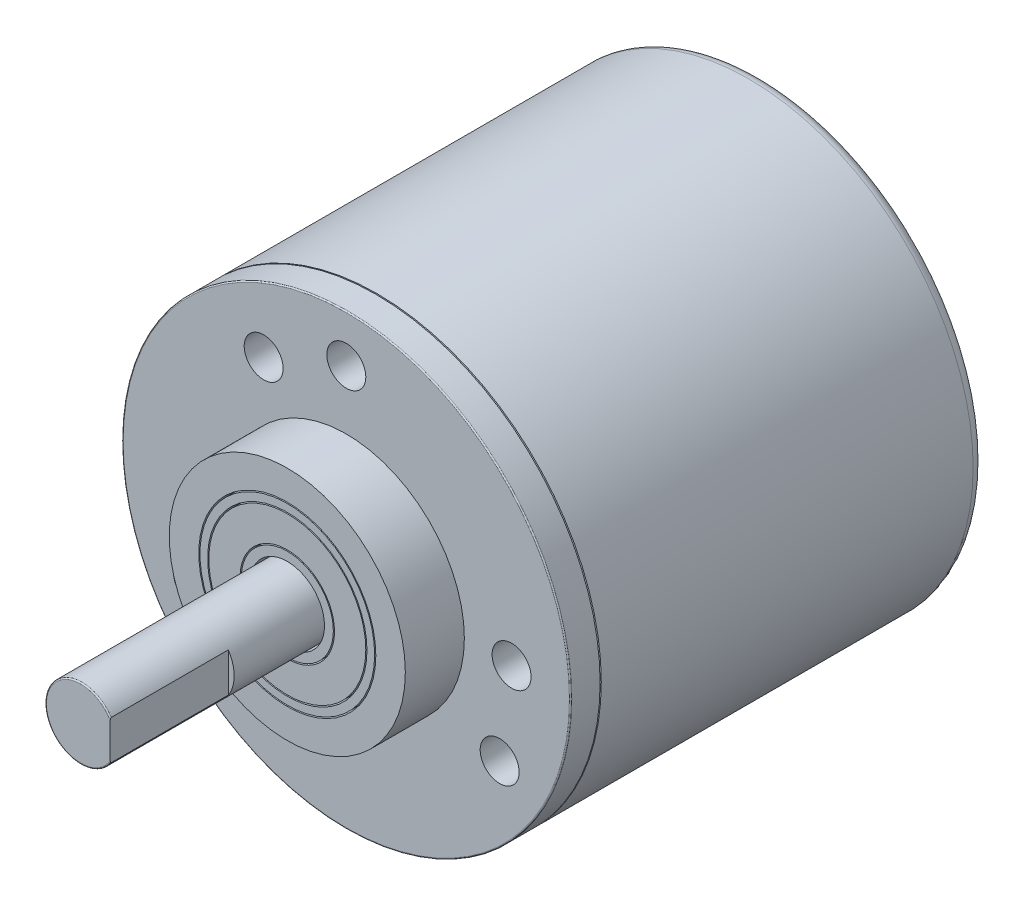
ISO-10303-21;
HEADER;
FILE_DESCRIPTION(('STEP AP214'),'2;1');
FILE_NAME('part.step','',(''),(''),'','','');
FILE_SCHEMA(('AUTOMOTIVE_DESIGN { 1 0 10303 214 1 1 1 1 }'));
ENDSEC;
DATA;
#1=APPLICATION_CONTEXT('core data for automotive mechanical design processes');
#2=APPLICATION_PROTOCOL_DEFINITION('international standard','automotive_design',2000,#1);
#3=PRODUCT_CONTEXT('',#1,'mechanical');
#4=PRODUCT('Part','Part','',(#3));
#5=PRODUCT_RELATED_PRODUCT_CATEGORY('part','',(#4));
#6=PRODUCT_DEFINITION_FORMATION('','',#4);
#7=PRODUCT_DEFINITION_CONTEXT('part definition',#1,'design');
#8=PRODUCT_DEFINITION('design','',#6,#7);
#9=PRODUCT_DEFINITION_SHAPE('','',#8);
#10=(LENGTH_UNIT() NAMED_UNIT(*) SI_UNIT(.MILLI.,.METRE.));
#11=(NAMED_UNIT(*) PLANE_ANGLE_UNIT() SI_UNIT($,.RADIAN.));
#12=(NAMED_UNIT(*) SI_UNIT($,.STERADIAN.) SOLID_ANGLE_UNIT());
#13=UNCERTAINTY_MEASURE_WITH_UNIT(LENGTH_MEASURE(1.E-05),#10,'distance_accuracy_value','');
#14=(GEOMETRIC_REPRESENTATION_CONTEXT(3) GLOBAL_UNCERTAINTY_ASSIGNED_CONTEXT((#13)) GLOBAL_UNIT_ASSIGNED_CONTEXT((#10,
#11,#12)) REPRESENTATION_CONTEXT('',''));
#15=CARTESIAN_POINT('',(0.,0.,0.));
#16=DIRECTION('',(0.,0.,1.));
#17=DIRECTION('',(1.,0.,0.));
#18=AXIS2_PLACEMENT_3D('',#15,#16,#17);
#19=CARTESIAN_POINT('',(0.,0.,57.5));
#20=DIRECTION('',(0.,0.,1.));
#21=DIRECTION('',(1.,0.,0.));
#22=AXIS2_PLACEMENT_3D('',#19,#20,#21);
#23=TOROIDAL_SURFACE('',#22,2.9,0.1);
#24=CARTESIAN_POINT('',(0.,0.,57.6));
#25=DIRECTION('',(0.,0.,1.));
#26=DIRECTION('',(1.,0.,0.));
#27=AXIS2_PLACEMENT_3D('',#24,#25,#26);
#28=CIRCLE('',#27,2.9);
#29=CARTESIAN_POINT('',(2.5,1.46969384566991,57.6));
#30=VERTEX_POINT('',#29);
#31=CARTESIAN_POINT('',(2.5,-1.46969384566991,57.6));
#32=VERTEX_POINT('',#31);
#33=EDGE_CURVE('E210',#30,#32,#28,.T.);
#34=ORIENTED_EDGE('',*,*,#33,.F.);
#35=CARTESIAN_POINT('',(2.5,1.6583123951777,57.5));
#36=CARTESIAN_POINT('',(2.5,1.65832016747273,57.5033043315846));
#37=CARTESIAN_POINT('',(2.5,1.65801657233733,57.5066002258474));
#38=CARTESIAN_POINT('',(2.5,1.6568546929146,57.5130648082912));
#39=CARTESIAN_POINT('',(2.5,1.65600120446499,57.516234347065));
#40=CARTESIAN_POINT('',(2.5,1.65380868232464,57.5223866973467));
#41=CARTESIAN_POINT('',(2.5,1.65247105389026,57.5253700202735));
#42=CARTESIAN_POINT('',(2.5,1.64939483067058,57.53112702301));
#43=CARTESIAN_POINT('',(2.5,1.64765531532508,57.5339002017954));
#44=CARTESIAN_POINT('',(2.5,1.64258823650373,57.5409942628953));
#45=CARTESIAN_POINT('',(2.5,1.6389760105066,57.5451117277358));
#46=CARTESIAN_POINT('',(2.5,1.63116073267224,57.5527388982134));
#47=CARTESIAN_POINT('',(2.5,1.62695610136376,57.5562469212209));
#48=CARTESIAN_POINT('',(2.5,1.61517985238653,57.5649124894146));
#49=CARTESIAN_POINT('',(2.5,1.60725247865166,57.5695834830336));
#50=CARTESIAN_POINT('',(2.5,1.59081085802323,57.5777187365064));
#51=CARTESIAN_POINT('',(2.5,1.58229525560931,57.5811800896697));
#52=CARTESIAN_POINT('',(2.5,1.55816356303633,57.5894377666878));
#53=CARTESIAN_POINT('',(2.5,1.54218536816765,57.5931725162884));
#54=CARTESIAN_POINT('',(2.5,1.50985447657944,57.5982642473057));
#55=CARTESIAN_POINT('',(2.5,1.49350079252433,57.5996139959403));
#56=CARTESIAN_POINT('',(2.5,1.45940800421217,57.6002693722088));
#57=CARTESIAN_POINT('',(2.5,1.44166495945654,57.5993988287185));
#58=CARTESIAN_POINT('',(2.5,1.41535304430469,57.5963405067919));
#59=CARTESIAN_POINT('',(2.5,1.40667255862976,57.5950390433996));
#60=CARTESIAN_POINT('',(2.5,1.38942535559259,57.5918253448798));
#61=CARTESIAN_POINT('',(2.5,1.38085864504972,57.5899130733125));
#62=CARTESIAN_POINT('',(2.5,1.37236992406489,57.5876783681764));
#63=B_SPLINE_CURVE_WITH_KNOTS('',3,(#35,#36,#37,#38,#39,#40,#41,#42,#43,#44,#45,#46,#47,#48,#49,
#50,#51,#52,#53,#54,#55,#56,#57,#58,#59,#60,#61,#62),.UNSPECIFIED.,.F.,.F.,(4,2,2,2,2,2,2,2,2,2,
2,2,2,4),(0.,0.00988566562161051,0.0196862605432219,0.0294586336099737,0.0392536171390137,
0.0555908527347773,0.0719725012890701,0.0994204413165509,0.126933890702367,0.175887268292354,
0.224988849318987,0.278105433700327,0.304419885579329,0.330735907624068),.UNSPECIFIED.);
#64=CARTESIAN_POINT('',(2.5,1.6583123951777,57.5));
#65=VERTEX_POINT('',#64);
#66=EDGE_CURVE('E213',#65,#30,#63,.T.);
#67=ORIENTED_EDGE('',*,*,#66,.F.);
#68=CARTESIAN_POINT('',(0.,0.,57.5));
#69=DIRECTION('',(0.,0.,1.));
#70=DIRECTION('',(1.,0.,0.));
#71=AXIS2_PLACEMENT_3D('',#68,#69,#70);
#72=CIRCLE('',#71,3.);
#73=CARTESIAN_POINT('',(2.5,-1.6583123951777,57.5));
#74=VERTEX_POINT('',#73);
#75=EDGE_CURVE('E55',#74,#65,#72,.F.);
#76=ORIENTED_EDGE('',*,*,#75,.F.);
#77=CARTESIAN_POINT('',(2.5,-1.46969384566991,57.6));
#78=CARTESIAN_POINT('',(2.5,-1.47810925765124,57.5999973788352));
#79=CARTESIAN_POINT('',(2.5,-1.48651836655769,57.5997277262453));
#80=CARTESIAN_POINT('',(2.5,-1.50332398214389,57.5986099843118));
#81=CARTESIAN_POINT('',(2.5,-1.51172036691204,57.5977600863656));
#82=CARTESIAN_POINT('',(2.5,-1.53688791569613,57.5942647180817));
#83=CARTESIAN_POINT('',(2.5,-1.55355942531334,57.5906727650936));
#84=CARTESIAN_POINT('',(2.5,-1.57602029228909,57.5834080329952));
#85=CARTESIAN_POINT('',(2.5,-1.58226416184587,57.581111728344));
#86=CARTESIAN_POINT('',(2.5,-1.59451045067397,57.5759338303621));
#87=CARTESIAN_POINT('',(2.5,-1.60051287515901,57.5730522496778));
#88=CARTESIAN_POINT('',(2.5,-1.61219827924205,57.5665775882826));
#89=CARTESIAN_POINT('',(2.5,-1.61787785242862,57.5629782678524));
#90=CARTESIAN_POINT('',(2.5,-1.62862955339004,57.5549575685428));
#91=CARTESIAN_POINT('',(2.5,-1.63370313393867,57.5505382233183));
#92=CARTESIAN_POINT('',(2.5,-1.64097163485322,57.5427723045354));
#93=CARTESIAN_POINT('',(2.5,-1.64349231113633,57.5397320136597));
#94=CARTESIAN_POINT('',(2.5,-1.64806921646917,57.5333172153581));
#95=CARTESIAN_POINT('',(2.5,-1.65012584989765,57.5299430026383));
#96=CARTESIAN_POINT('',(2.5,-1.653653564797,57.5228406553153));
#97=CARTESIAN_POINT('',(2.5,-1.6551168506931,57.5191085586367));
#98=CARTESIAN_POINT('',(2.5,-1.65726471976403,57.5114250035943));
#99=CARTESIAN_POINT('',(2.5,-1.65795047905608,57.5074738860524));
#100=CARTESIAN_POINT('',(2.5,-1.65841532318103,57.5001165615912));
#101=CARTESIAN_POINT('',(2.5,-1.65831499581992,57.4967175330463));
#102=CARTESIAN_POINT('',(2.5,-1.65750735578859,57.4899701216566));
#103=CARTESIAN_POINT('',(2.5,-1.65679619745144,57.4866221967504));
#104=CARTESIAN_POINT('',(2.5,-1.65579088619706,57.483366437867));
#105=B_SPLINE_CURVE_WITH_KNOTS('',3,(#77,#78,#79,#80,#81,#82,#83,#84,#85,#86,#87,#88,#89,#90,
#91,#92,#93,#94,#95,#96,#97,#98,#99,#100,#101,#102,#103,#104),.UNSPECIFIED.,.F.,.F.,(4,2,2,2,2,
2,2,2,2,2,2,2,2,4),(0.,0.0252278596581849,0.0505347147733773,0.101380931299572,
0.121318175249538,0.141254988446909,0.161373338353004,0.181442446056375,0.193257887548058,
0.205062992652412,0.217018528762323,0.228955956231327,0.239102493319808,0.249313383120048),.UNSPECIFIED.);
#106=EDGE_CURVE('E221',#32,#74,#105,.T.);
#107=ORIENTED_EDGE('',*,*,#106,.F.);
#108=EDGE_LOOP('',(#34,#67,#76,#107));
#109=FACE_BOUND('',#108,.T.);
#110=ADVANCED_FACE('F40',(#109),#23,.T.);
#111=CARTESIAN_POINT('',(0.,0.,32.5));
#112=DIRECTION('',(0.,0.,-1.));
#113=DIRECTION('',(-1.,0.,0.));
#114=AXIS2_PLACEMENT_3D('',#111,#112,#113);
#115=CYLINDRICAL_SURFACE('',#114,19.);
#116=CARTESIAN_POINT('',(0.,0.,1.));
#117=DIRECTION('',(0.,0.,1.));
#118=DIRECTION('',(1.,0.,0.));
#119=AXIS2_PLACEMENT_3D('',#116,#117,#118);
#120=CIRCLE('',#119,19.);
#121=CARTESIAN_POINT('',(19.,0.,1.));
#122=VERTEX_POINT('',#121);
#123=EDGE_CURVE('E48',#122,#122,#120,.T.);
#124=ORIENTED_EDGE('',*,*,#123,.T.);
#125=EDGE_LOOP('',(#124));
#126=FACE_BOUND('',#125,.T.);
#127=CARTESIAN_POINT('',(0.,0.,32.5));
#128=DIRECTION('',(0.,0.,1.));
#129=DIRECTION('',(1.,0.,0.));
#130=AXIS2_PLACEMENT_3D('',#127,#128,#129);
#131=CIRCLE('',#130,19.);
#132=CARTESIAN_POINT('',(19.,0.,32.5));
#133=VERTEX_POINT('',#132);
#134=EDGE_CURVE('E191',#133,#133,#131,.T.);
#135=ORIENTED_EDGE('',*,*,#134,.F.);
#136=EDGE_LOOP('',(#135));
#137=FACE_BOUND('',#136,.T.);
#138=ADVANCED_FACE('F325',(#126,#137),#115,.T.);
#139=CARTESIAN_POINT('',(0.,0.,32.5));
#140=DIRECTION('',(0.,0.,1.));
#141=DIRECTION('',(1.,0.,0.));
#142=AXIS2_PLACEMENT_3D('',#139,#140,#141);
#143=PLANE('',#142);
#144=CARTESIAN_POINT('',(0.,0.,32.5));
#145=DIRECTION('',(0.,0.,1.));
#146=DIRECTION('',(1.,0.,0.));
#147=AXIS2_PLACEMENT_3D('',#144,#145,#146);
#148=CIRCLE('',#147,18.5);
#149=CARTESIAN_POINT('',(18.5,0.,32.5));
#150=VERTEX_POINT('',#149);
#151=EDGE_CURVE('E185',#150,#150,#148,.T.);
#152=ORIENTED_EDGE('',*,*,#151,.F.);
#153=EDGE_LOOP('',(#152));
#154=FACE_BOUND('',#153,.T.);
#155=ORIENTED_EDGE('',*,*,#134,.T.);
#156=EDGE_LOOP('',(#155));
#157=FACE_BOUND('',#156,.T.);
#158=ADVANCED_FACE('F322',(#154,#157),#143,.T.);
#159=CARTESIAN_POINT('',(0.,0.,0.));
#160=DIRECTION('',(0.,0.,1.));
#161=DIRECTION('',(1.,0.,0.));
#162=AXIS2_PLACEMENT_3D('',#159,#160,#161);
#163=PLANE('',#162);
#164=CARTESIAN_POINT('',(0.,0.,0.));
#165=DIRECTION('',(0.,0.,1.));
#166=DIRECTION('',(1.,0.,0.));
#167=AXIS2_PLACEMENT_3D('',#164,#165,#166);
#168=CIRCLE('',#167,18.);
#169=CARTESIAN_POINT('',(18.,0.,0.));
#170=VERTEX_POINT('',#169);
#171=EDGE_CURVE('E11',#170,#170,#168,.F.);
#172=ORIENTED_EDGE('',*,*,#171,.T.);
#173=EDGE_LOOP('',(#172));
#174=FACE_BOUND('',#173,.T.);
#175=ADVANCED_FACE('F320',(#174),#163,.F.);
#176=CARTESIAN_POINT('',(0.,0.,32.6));
#177=DIRECTION('',(0.,0.,-1.));
#178=DIRECTION('',(-1.,0.,0.));
#179=AXIS2_PLACEMENT_3D('',#176,#177,#178);
#180=CYLINDRICAL_SURFACE('',#179,18.5);
#181=CARTESIAN_POINT('',(0.,0.,32.6));
#182=DIRECTION('',(0.,0.,1.));
#183=DIRECTION('',(1.,0.,0.));
#184=AXIS2_PLACEMENT_3D('',#181,#182,#183);
#185=CIRCLE('',#184,18.5);
#186=CARTESIAN_POINT('',(18.5,0.,32.6));
#187=VERTEX_POINT('',#186);
#188=EDGE_CURVE('E188',#187,#187,#185,.T.);
#189=ORIENTED_EDGE('',*,*,#188,.F.);
#190=EDGE_LOOP('',(#189));
#191=FACE_BOUND('',#190,.T.);
#192=ORIENTED_EDGE('',*,*,#151,.T.);
#193=EDGE_LOOP('',(#192));
#194=FACE_BOUND('',#193,.T.);
#195=ADVANCED_FACE('F316',(#191,#194),#180,.T.);
#196=CARTESIAN_POINT('',(0.,0.,35.1));
#197=DIRECTION('',(0.,0.,-1.));
#198=DIRECTION('',(-1.,0.,0.));
#199=AXIS2_PLACEMENT_3D('',#196,#197,#198);
#200=CYLINDRICAL_SURFACE('',#199,19.);
#201=CARTESIAN_POINT('',(0.,0.,35.));
#202=DIRECTION('',(0.,0.,1.));
#203=DIRECTION('',(1.,0.,0.));
#204=AXIS2_PLACEMENT_3D('',#201,#202,#203);
#205=CIRCLE('',#204,19.);
#206=CARTESIAN_POINT('',(19.,0.,35.));
#207=VERTEX_POINT('',#206);
#208=EDGE_CURVE('E340',#207,#207,#205,.F.);
#209=ORIENTED_EDGE('',*,*,#208,.T.);
#210=EDGE_LOOP('',(#209));
#211=FACE_BOUND('',#210,.T.);
#212=CARTESIAN_POINT('',(0.,0.,32.6));
#213=DIRECTION('',(0.,0.,1.));
#214=DIRECTION('',(1.,0.,0.));
#215=AXIS2_PLACEMENT_3D('',#212,#213,#214);
#216=CIRCLE('',#215,19.);
#217=CARTESIAN_POINT('',(19.,0.,32.6));
#218=VERTEX_POINT('',#217);
#219=EDGE_CURVE('E180',#218,#218,#216,.T.);
#220=ORIENTED_EDGE('',*,*,#219,.T.);
#221=EDGE_LOOP('',(#220));
#222=FACE_BOUND('',#221,.T.);
#223=ADVANCED_FACE('F309',(#211,#222),#200,.T.);
#224=CARTESIAN_POINT('',(0.,0.,35.1));
#225=DIRECTION('',(0.,0.,1.));
#226=DIRECTION('',(1.,0.,0.));
#227=AXIS2_PLACEMENT_3D('',#224,#225,#226);
#228=PLANE('',#227);
#229=CARTESIAN_POINT('',(-6.99999999999993,12.1243556529822,35.1));
#230=DIRECTION('',(0.,0.,1.));
#231=DIRECTION('',(1.,0.,0.));
#232=AXIS2_PLACEMENT_3D('',#229,#230,#231);
#233=CIRCLE('',#232,1.64999999999999);
#234=CARTESIAN_POINT('',(-5.34999999999994,12.1243556529822,35.1));
#235=VERTEX_POINT('',#234);
#236=EDGE_CURVE('E100',#235,#235,#233,.T.);
#237=ORIENTED_EDGE('',*,*,#236,.F.);
#238=EDGE_LOOP('',(#237));
#239=FACE_BOUND('',#238,.T.);
#240=CARTESIAN_POINT('',(0.,15.,35.1));
#241=DIRECTION('',(0.,0.,1.));
#242=DIRECTION('',(1.,0.,0.));
#243=AXIS2_PLACEMENT_3D('',#240,#241,#242);
#244=CIRCLE('',#243,1.64999999999999);
#245=CARTESIAN_POINT('',(1.64999999999999,15.,35.1));
#246=VERTEX_POINT('',#245);
#247=EDGE_CURVE('E99',#246,#246,#244,.T.);
#248=ORIENTED_EDGE('',*,*,#247,.F.);
#249=EDGE_LOOP('',(#248));
#250=FACE_BOUND('',#249,.T.);
#251=CARTESIAN_POINT('',(14.0000000000009,-2.67147415300428E-13,35.1));
#252=DIRECTION('',(0.,0.,1.));
#253=DIRECTION('',(1.,0.,0.));
#254=AXIS2_PLACEMENT_3D('',#251,#252,#253);
#255=CIRCLE('',#254,1.64999999999999);
#256=CARTESIAN_POINT('',(15.6500000000008,-2.67147415300428E-13,35.1));
#257=VERTEX_POINT('',#256);
#258=EDGE_CURVE('E110',#257,#257,#255,.T.);
#259=ORIENTED_EDGE('',*,*,#258,.F.);
#260=EDGE_LOOP('',(#259));
#261=FACE_BOUND('',#260,.T.);
#262=CARTESIAN_POINT('',(12.9903810567656,-7.50000000000172,35.1));
#263=DIRECTION('',(0.,0.,1.));
#264=DIRECTION('',(1.,0.,0.));
#265=AXIS2_PLACEMENT_3D('',#262,#263,#264);
#266=CIRCLE('',#265,1.64999999999999);
#267=CARTESIAN_POINT('',(14.6403810567656,-7.50000000000172,35.1));
#268=VERTEX_POINT('',#267);
#269=EDGE_CURVE('E116',#268,#268,#266,.T.);
#270=ORIENTED_EDGE('',*,*,#269,.F.);
#271=EDGE_LOOP('',(#270));
#272=FACE_BOUND('',#271,.T.);
#273=CARTESIAN_POINT('',(-7.00000000000088,-12.1243556529811,35.1));
#274=DIRECTION('',(0.,0.,1.));
#275=DIRECTION('',(1.,0.,0.));
#276=AXIS2_PLACEMENT_3D('',#273,#274,#275);
#277=CIRCLE('',#276,1.64999999999999);
#278=CARTESIAN_POINT('',(-5.35000000000089,-12.1243556529811,35.1));
#279=VERTEX_POINT('',#278);
#280=EDGE_CURVE('E122',#279,#279,#277,.T.);
#281=ORIENTED_EDGE('',*,*,#280,.F.);
#282=EDGE_LOOP('',(#281));
#283=FACE_BOUND('',#282,.T.);
#284=CARTESIAN_POINT('',(-12.9903810567686,-7.49999999999657,35.1));
#285=DIRECTION('',(0.,0.,1.));
#286=DIRECTION('',(1.,0.,0.));
#287=AXIS2_PLACEMENT_3D('',#284,#285,#286);
#288=CIRCLE('',#287,1.64999999999999);
#289=CARTESIAN_POINT('',(-11.3403810567686,-7.49999999999657,35.1));
#290=VERTEX_POINT('',#289);
#291=EDGE_CURVE('E128',#290,#290,#288,.T.);
#292=ORIENTED_EDGE('',*,*,#291,.F.);
#293=EDGE_LOOP('',(#292));
#294=FACE_BOUND('',#293,.T.);
#295=CARTESIAN_POINT('',(0.,0.,35.1));
#296=DIRECTION('',(0.,0.,1.));
#297=DIRECTION('',(1.,0.,0.));
#298=AXIS2_PLACEMENT_3D('',#295,#296,#297);
#299=CIRCLE('',#298,18.9);
#300=CARTESIAN_POINT('',(18.9,0.,35.1));
#301=VERTEX_POINT('',#300);
#302=EDGE_CURVE('E342',#301,#301,#299,.T.);
#303=ORIENTED_EDGE('',*,*,#302,.T.);
#304=EDGE_LOOP('',(#303));
#305=FACE_BOUND('',#304,.T.);
#306=CARTESIAN_POINT('',(0.,0.,35.1));
#307=DIRECTION('',(0.,0.,1.));
#308=DIRECTION('',(1.,0.,0.));
#309=AXIS2_PLACEMENT_3D('',#306,#307,#308);
#310=CIRCLE('',#309,10.);
#311=CARTESIAN_POINT('',(10.,0.,35.1));
#312=VERTEX_POINT('',#311);
#313=EDGE_CURVE('E181',#312,#312,#310,.T.);
#314=ORIENTED_EDGE('',*,*,#313,.F.);
#315=EDGE_LOOP('',(#314));
#316=FACE_BOUND('',#315,.T.);
#317=ADVANCED_FACE('F306',(#239,#250,#261,#272,#283,#294,#305,#316),#228,.T.);
#318=CARTESIAN_POINT('',(0.,0.,32.6));
#319=DIRECTION('',(0.,0.,1.));
#320=DIRECTION('',(1.,0.,0.));
#321=AXIS2_PLACEMENT_3D('',#318,#319,#320);
#322=PLANE('',#321);
#323=ORIENTED_EDGE('',*,*,#188,.T.);
#324=EDGE_LOOP('',(#323));
#325=FACE_BOUND('',#324,.T.);
#326=ORIENTED_EDGE('',*,*,#219,.F.);
#327=EDGE_LOOP('',(#326));
#328=FACE_BOUND('',#327,.T.);
#329=ADVANCED_FACE('F304',(#325,#328),#322,.F.);
#330=CARTESIAN_POINT('',(0.,0.,40.1));
#331=DIRECTION('',(0.,0.,-1.));
#332=DIRECTION('',(-1.,0.,0.));
#333=AXIS2_PLACEMENT_3D('',#330,#331,#332);
#334=CYLINDRICAL_SURFACE('',#333,10.);
#335=CARTESIAN_POINT('',(0.,0.,40.1));
#336=DIRECTION('',(0.,0.,1.));
#337=DIRECTION('',(1.,0.,0.));
#338=AXIS2_PLACEMENT_3D('',#335,#336,#337);
#339=CIRCLE('',#338,10.);
#340=CARTESIAN_POINT('',(10.,0.,40.1));
#341=VERTEX_POINT('',#340);
#342=EDGE_CURVE('E175',#341,#341,#339,.T.);
#343=ORIENTED_EDGE('',*,*,#342,.F.);
#344=EDGE_LOOP('',(#343));
#345=FACE_BOUND('',#344,.T.);
#346=ORIENTED_EDGE('',*,*,#313,.T.);
#347=EDGE_LOOP('',(#346));
#348=FACE_BOUND('',#347,.T.);
#349=ADVANCED_FACE('F300',(#345,#348),#334,.T.);
#350=CARTESIAN_POINT('',(0.,0.,40.1));
#351=DIRECTION('',(0.,0.,1.));
#352=DIRECTION('',(1.,0.,0.));
#353=AXIS2_PLACEMENT_3D('',#350,#351,#352);
#354=PLANE('',#353);
#355=CARTESIAN_POINT('',(0.,0.,40.1));
#356=DIRECTION('',(0.,0.,1.));
#357=DIRECTION('',(1.,0.,0.));
#358=AXIS2_PLACEMENT_3D('',#355,#356,#357);
#359=CIRCLE('',#358,7.5);
#360=CARTESIAN_POINT('',(7.5,0.,40.1));
#361=VERTEX_POINT('',#360);
#362=EDGE_CURVE('E169',#361,#361,#359,.T.);
#363=ORIENTED_EDGE('',*,*,#362,.F.);
#364=EDGE_LOOP('',(#363));
#365=FACE_BOUND('',#364,.T.);
#366=ORIENTED_EDGE('',*,*,#342,.T.);
#367=EDGE_LOOP('',(#366));
#368=FACE_BOUND('',#367,.T.);
#369=ADVANCED_FACE('F296',(#365,#368),#354,.T.);
#370=CARTESIAN_POINT('',(0.,0.,37.1));
#371=DIRECTION('',(0.,0.,1.));
#372=DIRECTION('',(1.,0.,0.));
#373=AXIS2_PLACEMENT_3D('',#370,#371,#372);
#374=CYLINDRICAL_SURFACE('',#373,7.5);
#375=CARTESIAN_POINT('',(0.,0.,37.1));
#376=DIRECTION('',(0.,0.,1.));
#377=DIRECTION('',(1.,0.,0.));
#378=AXIS2_PLACEMENT_3D('',#375,#376,#377);
#379=CIRCLE('',#378,7.5);
#380=CARTESIAN_POINT('',(7.5,0.,37.1));
#381=VERTEX_POINT('',#380);
#382=EDGE_CURVE('E172',#381,#381,#379,.T.);
#383=ORIENTED_EDGE('',*,*,#382,.F.);
#384=EDGE_LOOP('',(#383));
#385=FACE_BOUND('',#384,.T.);
#386=ORIENTED_EDGE('',*,*,#362,.T.);
#387=EDGE_LOOP('',(#386));
#388=FACE_BOUND('',#387,.T.);
#389=ADVANCED_FACE('F292',(#385,#388),#374,.F.);
#390=CARTESIAN_POINT('',(0.,0.,37.1));
#391=DIRECTION('',(0.,0.,1.));
#392=DIRECTION('',(1.,0.,0.));
#393=AXIS2_PLACEMENT_3D('',#390,#391,#392);
#394=PLANE('',#393);
#395=CARTESIAN_POINT('',(0.,0.,37.1));
#396=DIRECTION('',(0.,0.,1.));
#397=DIRECTION('',(1.,0.,0.));
#398=AXIS2_PLACEMENT_3D('',#395,#396,#397);
#399=CIRCLE('',#398,7.4);
#400=CARTESIAN_POINT('',(7.4,0.,37.1));
#401=VERTEX_POINT('',#400);
#402=EDGE_CURVE('E165',#401,#401,#399,.T.);
#403=ORIENTED_EDGE('',*,*,#402,.F.);
#404=EDGE_LOOP('',(#403));
#405=FACE_BOUND('',#404,.T.);
#406=ORIENTED_EDGE('',*,*,#382,.T.);
#407=EDGE_LOOP('',(#406));
#408=FACE_BOUND('',#407,.T.);
#409=ADVANCED_FACE('F285',(#405,#408),#394,.T.);
#410=CARTESIAN_POINT('',(0.,0.,40.1));
#411=DIRECTION('',(0.,0.,1.));
#412=DIRECTION('',(1.,0.,0.));
#413=AXIS2_PLACEMENT_3D('',#410,#411,#412);
#414=PLANE('',#413);
#415=CARTESIAN_POINT('',(0.,0.,40.1));
#416=DIRECTION('',(0.,0.,1.));
#417=DIRECTION('',(1.,0.,0.));
#418=AXIS2_PLACEMENT_3D('',#415,#416,#417);
#419=CIRCLE('',#418,7.4);
#420=CARTESIAN_POINT('',(7.4,0.,40.1));
#421=VERTEX_POINT('',#420);
#422=EDGE_CURVE('E166',#421,#421,#419,.T.);
#423=ORIENTED_EDGE('',*,*,#422,.T.);
#424=EDGE_LOOP('',(#423));
#425=FACE_BOUND('',#424,.T.);
#426=CARTESIAN_POINT('',(0.,0.,40.1));
#427=DIRECTION('',(0.,0.,1.));
#428=DIRECTION('',(1.,0.,0.));
#429=AXIS2_PLACEMENT_3D('',#426,#427,#428);
#430=CIRCLE('',#429,6.75);
#431=CARTESIAN_POINT('',(6.75,0.,40.1));
#432=VERTEX_POINT('',#431);
#433=EDGE_CURVE('E160',#432,#432,#430,.T.);
#434=ORIENTED_EDGE('',*,*,#433,.F.);
#435=EDGE_LOOP('',(#434));
#436=FACE_BOUND('',#435,.T.);
#437=ADVANCED_FACE('F282',(#425,#436),#414,.T.);
#438=CARTESIAN_POINT('',(0.,0.,40.1));
#439=DIRECTION('',(0.,0.,-1.));
#440=DIRECTION('',(-1.,0.,0.));
#441=AXIS2_PLACEMENT_3D('',#438,#439,#440);
#442=CYLINDRICAL_SURFACE('',#441,7.4);
#443=ORIENTED_EDGE('',*,*,#422,.F.);
#444=EDGE_LOOP('',(#443));
#445=FACE_BOUND('',#444,.T.);
#446=ORIENTED_EDGE('',*,*,#402,.T.);
#447=EDGE_LOOP('',(#446));
#448=FACE_BOUND('',#447,.T.);
#449=ADVANCED_FACE('F280',(#445,#448),#442,.T.);
#450=CARTESIAN_POINT('',(0.,0.,40.1));
#451=DIRECTION('',(0.,0.,-1.));
#452=DIRECTION('',(-1.,0.,0.));
#453=AXIS2_PLACEMENT_3D('',#450,#451,#452);
#454=CYLINDRICAL_SURFACE('',#453,6.75);
#455=ORIENTED_EDGE('',*,*,#433,.T.);
#456=EDGE_LOOP('',(#455));
#457=FACE_BOUND('',#456,.T.);
#458=CARTESIAN_POINT('',(0.,0.,37.1));
#459=DIRECTION('',(0.,0.,1.));
#460=DIRECTION('',(1.,0.,0.));
#461=AXIS2_PLACEMENT_3D('',#458,#459,#460);
#462=CIRCLE('',#461,6.75);
#463=CARTESIAN_POINT('',(6.75,0.,37.1));
#464=VERTEX_POINT('',#463);
#465=EDGE_CURVE('E184',#464,#464,#462,.F.);
#466=ORIENTED_EDGE('',*,*,#465,.T.);
#467=EDGE_LOOP('',(#466));
#468=FACE_BOUND('',#467,.T.);
#469=ADVANCED_FACE('F277',(#457,#468),#454,.F.);
#470=CARTESIAN_POINT('',(0.,0.,37.1));
#471=DIRECTION('',(0.,0.,1.));
#472=DIRECTION('',(1.,0.,0.));
#473=AXIS2_PLACEMENT_3D('',#470,#471,#472);
#474=CIRCLE('',#473,6.65);
#475=CARTESIAN_POINT('',(6.65,0.,37.1));
#476=VERTEX_POINT('',#475);
#477=EDGE_CURVE('E156',#476,#476,#474,.T.);
#478=ORIENTED_EDGE('',*,*,#477,.F.);
#479=EDGE_LOOP('',(#478));
#480=FACE_BOUND('',#479,.T.);
#481=ORIENTED_EDGE('',*,*,#465,.F.);
#482=EDGE_LOOP('',(#481));
#483=FACE_BOUND('',#482,.T.);
#484=ADVANCED_FACE('F272',(#480,#483),#394,.T.);
#485=CARTESIAN_POINT('',(0.,0.,40.1));
#486=DIRECTION('',(0.,0.,1.));
#487=DIRECTION('',(1.,0.,0.));
#488=AXIS2_PLACEMENT_3D('',#485,#486,#487);
#489=PLANE('',#488);
#490=CARTESIAN_POINT('',(0.,0.,40.1));
#491=DIRECTION('',(0.,0.,1.));
#492=DIRECTION('',(1.,0.,0.));
#493=AXIS2_PLACEMENT_3D('',#490,#491,#492);
#494=CIRCLE('',#493,6.65);
#495=CARTESIAN_POINT('',(6.65,0.,40.1));
#496=VERTEX_POINT('',#495);
#497=EDGE_CURVE('E157',#496,#496,#494,.T.);
#498=ORIENTED_EDGE('',*,*,#497,.T.);
#499=EDGE_LOOP('',(#498));
#500=FACE_BOUND('',#499,.T.);
#501=CARTESIAN_POINT('',(0.,0.,40.1));
#502=DIRECTION('',(0.,0.,1.));
#503=DIRECTION('',(1.,0.,0.));
#504=AXIS2_PLACEMENT_3D('',#501,#502,#503);
#505=CIRCLE('',#504,4.);
#506=CARTESIAN_POINT('',(4.,0.,40.1));
#507=VERTEX_POINT('',#506);
#508=EDGE_CURVE('E151',#507,#507,#505,.T.);
#509=ORIENTED_EDGE('',*,*,#508,.F.);
#510=EDGE_LOOP('',(#509));
#511=FACE_BOUND('',#510,.T.);
#512=ADVANCED_FACE('F269',(#500,#511),#489,.T.);
#513=CARTESIAN_POINT('',(0.,0.,40.1));
#514=DIRECTION('',(0.,0.,-1.));
#515=DIRECTION('',(-1.,0.,0.));
#516=AXIS2_PLACEMENT_3D('',#513,#514,#515);
#517=CYLINDRICAL_SURFACE('',#516,6.65);
#518=ORIENTED_EDGE('',*,*,#497,.F.);
#519=EDGE_LOOP('',(#518));
#520=FACE_BOUND('',#519,.T.);
#521=ORIENTED_EDGE('',*,*,#477,.T.);
#522=EDGE_LOOP('',(#521));
#523=FACE_BOUND('',#522,.T.);
#524=ADVANCED_FACE('F267',(#520,#523),#517,.T.);
#525=CARTESIAN_POINT('',(0.,0.,40.1));
#526=DIRECTION('',(0.,0.,-1.));
#527=DIRECTION('',(-1.,0.,0.));
#528=AXIS2_PLACEMENT_3D('',#525,#526,#527);
#529=CYLINDRICAL_SURFACE('',#528,4.);
#530=ORIENTED_EDGE('',*,*,#508,.T.);
#531=EDGE_LOOP('',(#530));
#532=FACE_BOUND('',#531,.T.);
#533=CARTESIAN_POINT('',(0.,0.,37.1));
#534=DIRECTION('',(0.,0.,1.));
#535=DIRECTION('',(1.,0.,0.));
#536=AXIS2_PLACEMENT_3D('',#533,#534,#535);
#537=CIRCLE('',#536,4.);
#538=CARTESIAN_POINT('',(4.,0.,37.1));
#539=VERTEX_POINT('',#538);
#540=EDGE_CURVE('E198',#539,#539,#537,.F.);
#541=ORIENTED_EDGE('',*,*,#540,.T.);
#542=EDGE_LOOP('',(#541));
#543=FACE_BOUND('',#542,.T.);
#544=ADVANCED_FACE('F264',(#532,#543),#529,.F.);
#545=CARTESIAN_POINT('',(0.,0.,37.1));
#546=DIRECTION('',(0.,0.,1.));
#547=DIRECTION('',(1.,0.,0.));
#548=AXIS2_PLACEMENT_3D('',#545,#546,#547);
#549=CIRCLE('',#548,3.9);
#550=CARTESIAN_POINT('',(3.9,0.,37.1));
#551=VERTEX_POINT('',#550);
#552=EDGE_CURVE('E147',#551,#551,#549,.T.);
#553=ORIENTED_EDGE('',*,*,#552,.F.);
#554=EDGE_LOOP('',(#553));
#555=FACE_BOUND('',#554,.T.);
#556=ORIENTED_EDGE('',*,*,#540,.F.);
#557=EDGE_LOOP('',(#556));
#558=FACE_BOUND('',#557,.T.);
#559=ADVANCED_FACE('F259',(#555,#558),#394,.T.);
#560=CARTESIAN_POINT('',(0.,0.,40.1));
#561=DIRECTION('',(0.,0.,1.));
#562=DIRECTION('',(1.,0.,0.));
#563=AXIS2_PLACEMENT_3D('',#560,#561,#562);
#564=PLANE('',#563);
#565=CARTESIAN_POINT('',(0.,0.,40.1));
#566=DIRECTION('',(0.,0.,1.));
#567=DIRECTION('',(1.,0.,0.));
#568=AXIS2_PLACEMENT_3D('',#565,#566,#567);
#569=CIRCLE('',#568,3.9);
#570=CARTESIAN_POINT('',(3.9,0.,40.1));
#571=VERTEX_POINT('',#570);
#572=EDGE_CURVE('E148',#571,#571,#569,.T.);
#573=ORIENTED_EDGE('',*,*,#572,.T.);
#574=EDGE_LOOP('',(#573));
#575=FACE_BOUND('',#574,.T.);
#576=CARTESIAN_POINT('',(0.,0.,40.1));
#577=DIRECTION('',(0.,0.,1.));
#578=DIRECTION('',(1.,0.,0.));
#579=AXIS2_PLACEMENT_3D('',#576,#577,#578);
#580=CIRCLE('',#579,3.15);
#581=CARTESIAN_POINT('',(3.15,0.,40.1));
#582=VERTEX_POINT('',#581);
#583=EDGE_CURVE('E144',#582,#582,#580,.T.);
#584=ORIENTED_EDGE('',*,*,#583,.F.);
#585=EDGE_LOOP('',(#584));
#586=FACE_BOUND('',#585,.T.);
#587=ADVANCED_FACE('F256',(#575,#586),#564,.T.);
#588=CARTESIAN_POINT('',(0.,0.,40.1));
#589=DIRECTION('',(0.,0.,-1.));
#590=DIRECTION('',(-1.,0.,0.));
#591=AXIS2_PLACEMENT_3D('',#588,#589,#590);
#592=CYLINDRICAL_SURFACE('',#591,3.9);
#593=ORIENTED_EDGE('',*,*,#572,.F.);
#594=EDGE_LOOP('',(#593));
#595=FACE_BOUND('',#594,.T.);
#596=ORIENTED_EDGE('',*,*,#552,.T.);
#597=EDGE_LOOP('',(#596));
#598=FACE_BOUND('',#597,.T.);
#599=ADVANCED_FACE('F254',(#595,#598),#592,.T.);
#600=CARTESIAN_POINT('',(0.,0.,40.1));
#601=DIRECTION('',(0.,0.,-1.));
#602=DIRECTION('',(-1.,0.,0.));
#603=AXIS2_PLACEMENT_3D('',#600,#601,#602);
#604=CYLINDRICAL_SURFACE('',#603,3.15);
#605=ORIENTED_EDGE('',*,*,#583,.T.);
#606=EDGE_LOOP('',(#605));
#607=FACE_BOUND('',#606,.T.);
#608=CARTESIAN_POINT('',(0.,0.,37.1));
#609=DIRECTION('',(0.,0.,1.));
#610=DIRECTION('',(1.,0.,0.));
#611=AXIS2_PLACEMENT_3D('',#608,#609,#610);
#612=CIRCLE('',#611,3.15);
#613=CARTESIAN_POINT('',(3.15,0.,37.1));
#614=VERTEX_POINT('',#613);
#615=EDGE_CURVE('E201',#614,#614,#612,.F.);
#616=ORIENTED_EDGE('',*,*,#615,.T.);
#617=EDGE_LOOP('',(#616));
#618=FACE_BOUND('',#617,.T.);
#619=ADVANCED_FACE('F251',(#607,#618),#604,.F.);
#620=CARTESIAN_POINT('',(0.,0.,37.1));
#621=DIRECTION('',(0.,0.,1.));
#622=DIRECTION('',(1.,0.,0.));
#623=AXIS2_PLACEMENT_3D('',#620,#621,#622);
#624=CIRCLE('',#623,3.);
#625=CARTESIAN_POINT('',(3.,0.,37.1));
#626=VERTEX_POINT('',#625);
#627=EDGE_CURVE('E141',#626,#626,#624,.T.);
#628=ORIENTED_EDGE('',*,*,#627,.F.);
#629=EDGE_LOOP('',(#628));
#630=FACE_BOUND('',#629,.T.);
#631=ORIENTED_EDGE('',*,*,#615,.F.);
#632=EDGE_LOOP('',(#631));
#633=FACE_BOUND('',#632,.T.);
#634=ADVANCED_FACE('F250',(#630,#633),#394,.T.);
#635=CARTESIAN_POINT('',(0.,0.,57.6));
#636=DIRECTION('',(0.,0.,-1.));
#637=DIRECTION('',(-1.,0.,0.));
#638=AXIS2_PLACEMENT_3D('',#635,#636,#637);
#639=CYLINDRICAL_SURFACE('',#638,3.);
#640=DIRECTION('',(0.,0.,-1.));
#641=VECTOR('',#640,1.);
#642=CARTESIAN_POINT('',(2.5,-1.6583123951777,57.6));
#643=LINE('',#642,#641);
#644=CARTESIAN_POINT('',(2.5,-1.6583123951777,47.6));
#645=VERTEX_POINT('',#644);
#646=EDGE_CURVE('E137',#645,#74,#643,.F.);
#647=ORIENTED_EDGE('',*,*,#646,.T.);
#648=ORIENTED_EDGE('',*,*,#75,.T.);
#649=DIRECTION('',(0.,0.,-1.));
#650=VECTOR('',#649,1.);
#651=CARTESIAN_POINT('',(2.5,1.6583123951777,57.6));
#652=LINE('',#651,#650);
#653=CARTESIAN_POINT('',(2.5,1.6583123951777,47.6));
#654=VERTEX_POINT('',#653);
#655=EDGE_CURVE('E139',#65,#654,#652,.T.);
#656=ORIENTED_EDGE('',*,*,#655,.T.);
#657=CARTESIAN_POINT('',(0.,0.,47.6));
#658=DIRECTION('',(0.,0.,-1.));
#659=DIRECTION('',(-1.,0.,0.));
#660=AXIS2_PLACEMENT_3D('',#657,#658,#659);
#661=CIRCLE('',#660,3.);
#662=EDGE_CURVE('E207',#654,#645,#661,.T.);
#663=ORIENTED_EDGE('',*,*,#662,.T.);
#664=EDGE_LOOP('',(#647,#648,#656,#663));
#665=FACE_BOUND('',#664,.T.);
#666=ORIENTED_EDGE('',*,*,#627,.T.);
#667=EDGE_LOOP('',(#666));
#668=FACE_BOUND('',#667,.T.);
#669=ADVANCED_FACE('F246',(#665,#668),#639,.T.);
#670=CARTESIAN_POINT('',(0.,0.,57.6));
#671=DIRECTION('',(0.,0.,1.));
#672=DIRECTION('',(1.,0.,0.));
#673=AXIS2_PLACEMENT_3D('',#670,#671,#672);
#674=PLANE('',#673);
#675=DIRECTION('',(0.,-1.,0.));
#676=VECTOR('',#675,1.);
#677=CARTESIAN_POINT('',(2.5,0.,57.6));
#678=LINE('',#677,#676);
#679=EDGE_CURVE('E204',#30,#32,#678,.T.);
#680=ORIENTED_EDGE('',*,*,#679,.F.);
#681=ORIENTED_EDGE('',*,*,#33,.T.);
#682=EDGE_LOOP('',(#680,#681));
#683=FACE_BOUND('',#682,.T.);
#684=ADVANCED_FACE('F242',(#683),#674,.T.);
#685=CARTESIAN_POINT('',(2.5,-3.,47.6));
#686=DIRECTION('',(0.,0.,-1.));
#687=DIRECTION('',(-1.,0.,0.));
#688=AXIS2_PLACEMENT_3D('',#685,#686,#687);
#689=PLANE('',#688);
#690=DIRECTION('',(0.,1.,0.));
#691=VECTOR('',#690,1.);
#692=CARTESIAN_POINT('',(2.5,-3.,47.6));
#693=LINE('',#692,#691);
#694=EDGE_CURVE('E134',#645,#654,#693,.T.);
#695=ORIENTED_EDGE('',*,*,#694,.F.);
#696=ORIENTED_EDGE('',*,*,#662,.F.);
#697=EDGE_LOOP('',(#695,#696));
#698=FACE_BOUND('',#697,.T.);
#699=ADVANCED_FACE('F235',(#698),#689,.F.);
#700=CARTESIAN_POINT('',(2.5,0.,0.));
#701=DIRECTION('',(-1.,0.,0.));
#702=DIRECTION('',(0.,0.,1.));
#703=AXIS2_PLACEMENT_3D('',#700,#701,#702);
#704=PLANE('',#703);
#705=ORIENTED_EDGE('',*,*,#679,.T.);
#706=ORIENTED_EDGE('',*,*,#106,.T.);
#707=ORIENTED_EDGE('',*,*,#646,.F.);
#708=ORIENTED_EDGE('',*,*,#694,.T.);
#709=ORIENTED_EDGE('',*,*,#655,.F.);
#710=ORIENTED_EDGE('',*,*,#66,.T.);
#711=EDGE_LOOP('',(#705,#706,#707,#708,#709,#710));
#712=FACE_BOUND('',#711,.T.);
#713=ADVANCED_FACE('F229',(#712),#704,.F.);
#714=CARTESIAN_POINT('',(0.,0.,35.));
#715=DIRECTION('',(0.,0.,1.));
#716=DIRECTION('',(1.,0.,0.));
#717=AXIS2_PLACEMENT_3D('',#714,#715,#716);
#718=TOROIDAL_SURFACE('',#717,18.9,0.1);
#719=ORIENTED_EDGE('',*,*,#208,.F.);
#720=EDGE_LOOP('',(#719));
#721=FACE_BOUND('',#720,.T.);
#722=ORIENTED_EDGE('',*,*,#302,.F.);
#723=EDGE_LOOP('',(#722));
#724=FACE_BOUND('',#723,.T.);
#725=ADVANCED_FACE('F234',(#721,#724),#718,.T.);
#726=CARTESIAN_POINT('',(0.,0.,1.));
#727=DIRECTION('',(0.,0.,1.));
#728=DIRECTION('',(1.,0.,0.));
#729=AXIS2_PLACEMENT_3D('',#726,#727,#728);
#730=TOROIDAL_SURFACE('',#729,18.,1.);
#731=ORIENTED_EDGE('',*,*,#171,.F.);
#732=EDGE_LOOP('',(#731));
#733=FACE_BOUND('',#732,.T.);
#734=ORIENTED_EDGE('',*,*,#123,.F.);
#735=EDGE_LOOP('',(#734));
#736=FACE_BOUND('',#735,.T.);
#737=ADVANCED_FACE('F42',(#733,#736),#730,.T.);
#738=CARTESIAN_POINT('',(-12.9903810567686,-7.49999999999657,30.1));
#739=DIRECTION('',(0.,0.,1.));
#740=DIRECTION('',(1.,0.,0.));
#741=AXIS2_PLACEMENT_3D('',#738,#739,#740);
#742=CONICAL_SURFACE('',#741,1.65,1.02974425867665);
#743=CARTESIAN_POINT('',(-12.9903810567686,-7.49999999999657,29.1085799786045));
#744=VERTEX_POINT('',#743);
#745=VERTEX_LOOP('',#744);
#746=FACE_BOUND('',#745,.T.);
#747=CARTESIAN_POINT('',(-12.9903810567686,-7.49999999999657,30.1));
#748=DIRECTION('',(0.,0.,1.));
#749=DIRECTION('',(1.,0.,0.));
#750=AXIS2_PLACEMENT_3D('',#747,#748,#749);
#751=CIRCLE('',#750,1.65);
#752=CARTESIAN_POINT('',(-11.3403810567686,-7.49999999999657,30.1));
#753=VERTEX_POINT('',#752);
#754=EDGE_CURVE('E131',#753,#753,#751,.T.);
#755=ORIENTED_EDGE('',*,*,#754,.T.);
#756=EDGE_LOOP('',(#755));
#757=FACE_BOUND('',#756,.T.);
#758=ADVANCED_FACE('F237',(#746,#757),#742,.F.);
#759=CARTESIAN_POINT('',(-12.9903810567686,-7.49999999999657,35.1));
#760=DIRECTION('',(0.,0.,1.));
#761=DIRECTION('',(1.,0.,0.));
#762=AXIS2_PLACEMENT_3D('',#759,#760,#761);
#763=CYLINDRICAL_SURFACE('',#762,1.64999999999999);
#764=ORIENTED_EDGE('',*,*,#754,.F.);
#765=EDGE_LOOP('',(#764));
#766=FACE_BOUND('',#765,.T.);
#767=ORIENTED_EDGE('',*,*,#291,.T.);
#768=EDGE_LOOP('',(#767));
#769=FACE_BOUND('',#768,.T.);
#770=ADVANCED_FACE('F500',(#766,#769),#763,.F.);
#771=CARTESIAN_POINT('',(-7.00000000000088,-12.1243556529811,30.1));
#772=DIRECTION('',(0.,0.,1.));
#773=DIRECTION('',(1.,0.,0.));
#774=AXIS2_PLACEMENT_3D('',#771,#772,#773);
#775=CONICAL_SURFACE('',#774,1.65,1.02974425867665);
#776=CARTESIAN_POINT('',(-7.00000000000088,-12.1243556529811,29.1085799786045));
#777=VERTEX_POINT('',#776);
#778=VERTEX_LOOP('',#777);
#779=FACE_BOUND('',#778,.T.);
#780=CARTESIAN_POINT('',(-7.00000000000088,-12.1243556529811,30.1));
#781=DIRECTION('',(0.,0.,1.));
#782=DIRECTION('',(1.,0.,0.));
#783=AXIS2_PLACEMENT_3D('',#780,#781,#782);
#784=CIRCLE('',#783,1.65);
#785=CARTESIAN_POINT('',(-5.35000000000088,-12.1243556529811,30.1));
#786=VERTEX_POINT('',#785);
#787=EDGE_CURVE('E125',#786,#786,#784,.T.);
#788=ORIENTED_EDGE('',*,*,#787,.T.);
#789=EDGE_LOOP('',(#788));
#790=FACE_BOUND('',#789,.T.);
#791=ADVANCED_FACE('F511',(#779,#790),#775,.F.);
#792=CARTESIAN_POINT('',(-7.00000000000088,-12.1243556529811,35.1));
#793=DIRECTION('',(0.,0.,1.));
#794=DIRECTION('',(1.,0.,0.));
#795=AXIS2_PLACEMENT_3D('',#792,#793,#794);
#796=CYLINDRICAL_SURFACE('',#795,1.64999999999999);
#797=ORIENTED_EDGE('',*,*,#787,.F.);
#798=EDGE_LOOP('',(#797));
#799=FACE_BOUND('',#798,.T.);
#800=ORIENTED_EDGE('',*,*,#280,.T.);
#801=EDGE_LOOP('',(#800));
#802=FACE_BOUND('',#801,.T.);
#803=ADVANCED_FACE('F521',(#799,#802),#796,.F.);
#804=CARTESIAN_POINT('',(12.9903810567656,-7.50000000000172,30.1));
#805=DIRECTION('',(0.,0.,1.));
#806=DIRECTION('',(1.,0.,0.));
#807=AXIS2_PLACEMENT_3D('',#804,#805,#806);
#808=CONICAL_SURFACE('',#807,1.65,1.02974425867665);
#809=CARTESIAN_POINT('',(12.9903810567656,-7.50000000000172,29.1085799786045));
#810=VERTEX_POINT('',#809);
#811=VERTEX_LOOP('',#810);
#812=FACE_BOUND('',#811,.T.);
#813=CARTESIAN_POINT('',(12.9903810567656,-7.50000000000172,30.1));
#814=DIRECTION('',(0.,0.,1.));
#815=DIRECTION('',(1.,0.,0.));
#816=AXIS2_PLACEMENT_3D('',#813,#814,#815);
#817=CIRCLE('',#816,1.65);
#818=CARTESIAN_POINT('',(14.6403810567656,-7.50000000000172,30.1));
#819=VERTEX_POINT('',#818);
#820=EDGE_CURVE('E119',#819,#819,#817,.T.);
#821=ORIENTED_EDGE('',*,*,#820,.T.);
#822=EDGE_LOOP('',(#821));
#823=FACE_BOUND('',#822,.T.);
#824=ADVANCED_FACE('F532',(#812,#823),#808,.F.);
#825=CARTESIAN_POINT('',(12.9903810567656,-7.50000000000172,35.1));
#826=DIRECTION('',(0.,0.,1.));
#827=DIRECTION('',(1.,0.,0.));
#828=AXIS2_PLACEMENT_3D('',#825,#826,#827);
#829=CYLINDRICAL_SURFACE('',#828,1.64999999999999);
#830=ORIENTED_EDGE('',*,*,#820,.F.);
#831=EDGE_LOOP('',(#830));
#832=FACE_BOUND('',#831,.T.);
#833=ORIENTED_EDGE('',*,*,#269,.T.);
#834=EDGE_LOOP('',(#833));
#835=FACE_BOUND('',#834,.T.);
#836=ADVANCED_FACE('F543',(#832,#835),#829,.F.);
#837=CARTESIAN_POINT('',(14.0000000000009,-2.67147415300428E-13,30.1));
#838=DIRECTION('',(0.,0.,1.));
#839=DIRECTION('',(1.,0.,0.));
#840=AXIS2_PLACEMENT_3D('',#837,#838,#839);
#841=CONICAL_SURFACE('',#840,1.65,1.02974425867666);
#842=CARTESIAN_POINT('',(14.0000000000009,-2.67147415300428E-13,29.1085799786045));
#843=VERTEX_POINT('',#842);
#844=VERTEX_LOOP('',#843);
#845=FACE_BOUND('',#844,.T.);
#846=CARTESIAN_POINT('',(14.0000000000009,-2.67147415300428E-13,30.1));
#847=DIRECTION('',(0.,0.,1.));
#848=DIRECTION('',(1.,0.,0.));
#849=AXIS2_PLACEMENT_3D('',#846,#847,#848);
#850=CIRCLE('',#849,1.65);
#851=CARTESIAN_POINT('',(15.6500000000009,-2.67147415300428E-13,30.1));
#852=VERTEX_POINT('',#851);
#853=EDGE_CURVE('E113',#852,#852,#850,.T.);
#854=ORIENTED_EDGE('',*,*,#853,.T.);
#855=EDGE_LOOP('',(#854));
#856=FACE_BOUND('',#855,.T.);
#857=ADVANCED_FACE('F554',(#845,#856),#841,.F.);
#858=CARTESIAN_POINT('',(14.0000000000009,-2.67147415300428E-13,35.1));
#859=DIRECTION('',(0.,0.,1.));
#860=DIRECTION('',(1.,0.,0.));
#861=AXIS2_PLACEMENT_3D('',#858,#859,#860);
#862=CYLINDRICAL_SURFACE('',#861,1.65);
#863=ORIENTED_EDGE('',*,*,#853,.F.);
#864=EDGE_LOOP('',(#863));
#865=FACE_BOUND('',#864,.T.);
#866=ORIENTED_EDGE('',*,*,#258,.T.);
#867=EDGE_LOOP('',(#866));
#868=FACE_BOUND('',#867,.T.);
#869=ADVANCED_FACE('F566',(#865,#868),#862,.F.);
#870=CARTESIAN_POINT('',(0.,15.,30.1));
#871=DIRECTION('',(0.,0.,1.));
#872=DIRECTION('',(1.,0.,0.));
#873=AXIS2_PLACEMENT_3D('',#870,#871,#872);
#874=CONICAL_SURFACE('',#873,1.65,1.02974425867665);
#875=CARTESIAN_POINT('',(0.,15.,29.1085799786045));
#876=VERTEX_POINT('',#875);
#877=VERTEX_LOOP('',#876);
#878=FACE_BOUND('',#877,.T.);
#879=CARTESIAN_POINT('',(0.,15.,30.1));
#880=DIRECTION('',(0.,0.,1.));
#881=DIRECTION('',(1.,0.,0.));
#882=AXIS2_PLACEMENT_3D('',#879,#880,#881);
#883=CIRCLE('',#882,1.65);
#884=CARTESIAN_POINT('',(1.65,15.,30.1));
#885=VERTEX_POINT('',#884);
#886=EDGE_CURVE('E103',#885,#885,#883,.T.);
#887=ORIENTED_EDGE('',*,*,#886,.T.);
#888=EDGE_LOOP('',(#887));
#889=FACE_BOUND('',#888,.T.);
#890=ADVANCED_FACE('F577',(#878,#889),#874,.F.);
#891=CARTESIAN_POINT('',(0.,15.,35.1));
#892=DIRECTION('',(0.,0.,1.));
#893=DIRECTION('',(1.,0.,0.));
#894=AXIS2_PLACEMENT_3D('',#891,#892,#893);
#895=CYLINDRICAL_SURFACE('',#894,1.64999999999999);
#896=ORIENTED_EDGE('',*,*,#886,.F.);
#897=EDGE_LOOP('',(#896));
#898=FACE_BOUND('',#897,.T.);
#899=ORIENTED_EDGE('',*,*,#247,.T.);
#900=EDGE_LOOP('',(#899));
#901=FACE_BOUND('',#900,.T.);
#902=ADVANCED_FACE('F93',(#898,#901),#895,.F.);
#903=CARTESIAN_POINT('',(-6.99999999999993,12.1243556529822,30.1));
#904=DIRECTION('',(0.,0.,1.));
#905=DIRECTION('',(1.,0.,0.));
#906=AXIS2_PLACEMENT_3D('',#903,#904,#905);
#907=CONICAL_SURFACE('',#906,1.65,1.02974425867665);
#908=CARTESIAN_POINT('',(-6.99999999999993,12.1243556529822,29.1085799786045));
#909=VERTEX_POINT('',#908);
#910=VERTEX_LOOP('',#909);
#911=FACE_BOUND('',#910,.T.);
#912=CARTESIAN_POINT('',(-6.99999999999993,12.1243556529822,30.1));
#913=DIRECTION('',(0.,0.,1.));
#914=DIRECTION('',(1.,0.,0.));
#915=AXIS2_PLACEMENT_3D('',#912,#913,#914);
#916=CIRCLE('',#915,1.65);
#917=CARTESIAN_POINT('',(-5.34999999999993,12.1243556529822,30.1));
#918=VERTEX_POINT('',#917);
#919=EDGE_CURVE('E97',#918,#918,#916,.T.);
#920=ORIENTED_EDGE('',*,*,#919,.T.);
#921=EDGE_LOOP('',(#920));
#922=FACE_BOUND('',#921,.T.);
#923=ADVANCED_FACE('F89',(#911,#922),#907,.F.);
#924=CARTESIAN_POINT('',(-6.99999999999993,12.1243556529822,35.1));
#925=DIRECTION('',(0.,0.,1.));
#926=DIRECTION('',(1.,0.,0.));
#927=AXIS2_PLACEMENT_3D('',#924,#925,#926);
#928=CYLINDRICAL_SURFACE('',#927,1.64999999999999);
#929=ORIENTED_EDGE('',*,*,#919,.F.);
#930=EDGE_LOOP('',(#929));
#931=FACE_BOUND('',#930,.T.);
#932=ORIENTED_EDGE('',*,*,#236,.T.);
#933=EDGE_LOOP('',(#932));
#934=FACE_BOUND('',#933,.T.);
#935=ADVANCED_FACE('F92',(#931,#934),#928,.F.);
#936=CLOSED_SHELL('',(#110,#138,#158,#175,#195,#223,#317,#329,#349,#369,#389,#409,#437,#449,
#469,#484,#512,#524,#544,#559,#587,#599,#619,#634,#669,#684,#699,#713,#725,#737,#758,#770,#791,
#803,#824,#836,#857,#869,#890,#902,#923,#935));
#937=MANIFOLD_SOLID_BREP('B2',#936);
#938=ADVANCED_BREP_SHAPE_REPRESENTATION('',(#18,#937),#14);
#939=SHAPE_DEFINITION_REPRESENTATION(#9,#938);
ENDSEC;
END-ISO-10303-21;
